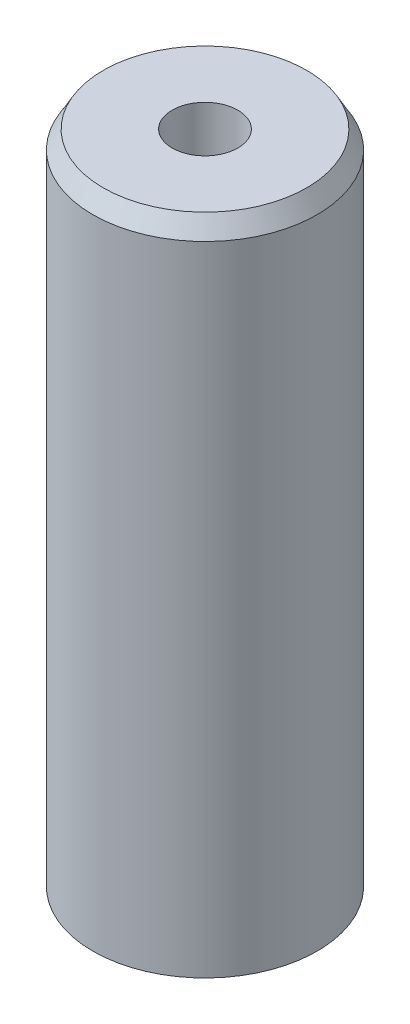
ISO-10303-21;
HEADER;
FILE_DESCRIPTION(('STEP AP214'),'2;1');
FILE_NAME('part.step','',(''),(''),'','','');
FILE_SCHEMA(('AUTOMOTIVE_DESIGN { 1 0 10303 214 1 1 1 1 }'));
ENDSEC;
DATA;
#1=APPLICATION_CONTEXT('core data for automotive mechanical design processes');
#2=APPLICATION_PROTOCOL_DEFINITION('international standard','automotive_design',2000,#1);
#3=PRODUCT_CONTEXT('',#1,'mechanical');
#4=PRODUCT('Part','Part','',(#3));
#5=PRODUCT_RELATED_PRODUCT_CATEGORY('part','',(#4));
#6=PRODUCT_DEFINITION_FORMATION('','',#4);
#7=PRODUCT_DEFINITION_CONTEXT('part definition',#1,'design');
#8=PRODUCT_DEFINITION('design','',#6,#7);
#9=PRODUCT_DEFINITION_SHAPE('','',#8);
#10=(LENGTH_UNIT() NAMED_UNIT(*) SI_UNIT(.MILLI.,.METRE.));
#11=(NAMED_UNIT(*) PLANE_ANGLE_UNIT() SI_UNIT($,.RADIAN.));
#12=(NAMED_UNIT(*) SI_UNIT($,.STERADIAN.) SOLID_ANGLE_UNIT());
#13=UNCERTAINTY_MEASURE_WITH_UNIT(LENGTH_MEASURE(1.E-05),#10,'distance_accuracy_value','');
#14=(GEOMETRIC_REPRESENTATION_CONTEXT(3) GLOBAL_UNCERTAINTY_ASSIGNED_CONTEXT((#13)) GLOBAL_UNIT_ASSIGNED_CONTEXT((#10,
#11,#12)) REPRESENTATION_CONTEXT('',''));
#15=CARTESIAN_POINT('',(0.,0.,0.));
#16=DIRECTION('',(0.,0.,1.));
#17=DIRECTION('',(1.,0.,0.));
#18=AXIS2_PLACEMENT_3D('',#15,#16,#17);
#19=CARTESIAN_POINT('',(0.,193.043494392686,0.));
#20=DIRECTION('',(0.,-1.,0.));
#21=DIRECTION('',(0.,0.,-1.));
#22=AXIS2_PLACEMENT_3D('',#19,#20,#21);
#23=CYLINDRICAL_SURFACE('',#22,32.5);
#24=CARTESIAN_POINT('',(0.,187.812756605636,0.));
#25=DIRECTION('',(0.,1.,0.));
#26=DIRECTION('',(0.,0.,1.));
#27=AXIS2_PLACEMENT_3D('',#24,#25,#26);
#28=CIRCLE('',#27,32.5);
#29=CARTESIAN_POINT('',(0.,187.812756605636,32.5));
#30=VERTEX_POINT('',#29);
#31=EDGE_CURVE('E50',#30,#30,#28,.F.);
#32=ORIENTED_EDGE('',*,*,#31,.T.);
#33=EDGE_LOOP('',(#32));
#34=FACE_BOUND('',#33,.T.);
#35=CARTESIAN_POINT('',(0.,3.01363000616731,0.));
#36=DIRECTION('',(0.,1.,0.));
#37=DIRECTION('',(0.,0.,1.));
#38=AXIS2_PLACEMENT_3D('',#35,#36,#37);
#39=CIRCLE('',#38,32.5);
#40=CARTESIAN_POINT('',(0.,3.01363000616731,32.5));
#41=VERTEX_POINT('',#40);
#42=EDGE_CURVE('E51',#41,#41,#39,.T.);
#43=ORIENTED_EDGE('',*,*,#42,.T.);
#44=EDGE_LOOP('',(#43));
#45=FACE_BOUND('',#44,.T.);
#46=ADVANCED_FACE('F39',(#34,#45),#23,.T.);
#47=CARTESIAN_POINT('',(0.,193.043494392686,0.));
#48=DIRECTION('',(0.,1.,0.));
#49=DIRECTION('',(0.,0.,1.));
#50=AXIS2_PLACEMENT_3D('',#47,#48,#49);
#51=PLANE('',#50);
#52=CARTESIAN_POINT('',(0.,193.043494392686,0.));
#53=DIRECTION('',(0.,1.,0.));
#54=DIRECTION('',(0.,0.,1.));
#55=AXIS2_PLACEMENT_3D('',#52,#53,#54);
#56=CIRCLE('',#55,29.4863699938327);
#57=CARTESIAN_POINT('',(0.,193.043494392686,29.4863699938327));
#58=VERTEX_POINT('',#57);
#59=EDGE_CURVE('E54',#58,#58,#56,.T.);
#60=ORIENTED_EDGE('',*,*,#59,.T.);
#61=EDGE_LOOP('',(#60));
#62=FACE_BOUND('',#61,.T.);
#63=CARTESIAN_POINT('',(0.,193.043494392686,0.));
#64=DIRECTION('',(0.,1.,0.));
#65=DIRECTION('',(0.,0.,1.));
#66=AXIS2_PLACEMENT_3D('',#63,#64,#65);
#67=CIRCLE('',#66,9.51298660513181);
#68=CARTESIAN_POINT('',(0.,193.043494392686,9.51298660513181));
#69=VERTEX_POINT('',#68);
#70=EDGE_CURVE('E58',#69,#69,#67,.T.);
#71=ORIENTED_EDGE('',*,*,#70,.F.);
#72=EDGE_LOOP('',(#71));
#73=FACE_BOUND('',#72,.T.);
#74=ADVANCED_FACE('F69',(#62,#73),#51,.T.);
#75=CARTESIAN_POINT('',(0.,0.,0.));
#76=DIRECTION('',(0.,1.,0.));
#77=DIRECTION('',(0.,0.,1.));
#78=AXIS2_PLACEMENT_3D('',#75,#76,#77);
#79=PLANE('',#78);
#80=CARTESIAN_POINT('',(0.,0.,0.));
#81=DIRECTION('',(0.,1.,0.));
#82=DIRECTION('',(0.,0.,1.));
#83=AXIS2_PLACEMENT_3D('',#80,#81,#82);
#84=CIRCLE('',#83,27.26926221295);
#85=CARTESIAN_POINT('',(0.,0.,27.26926221295));
#86=VERTEX_POINT('',#85);
#87=EDGE_CURVE('E10',#86,#86,#84,.F.);
#88=ORIENTED_EDGE('',*,*,#87,.T.);
#89=EDGE_LOOP('',(#88));
#90=FACE_BOUND('',#89,.T.);
#91=CARTESIAN_POINT('',(0.,0.,0.));
#92=DIRECTION('',(0.,1.,0.));
#93=DIRECTION('',(0.,0.,1.));
#94=AXIS2_PLACEMENT_3D('',#91,#92,#93);
#95=CIRCLE('',#94,9.51298660513181);
#96=CARTESIAN_POINT('',(0.,0.,9.51298660513181));
#97=VERTEX_POINT('',#96);
#98=EDGE_CURVE('E63',#97,#97,#95,.T.);
#99=ORIENTED_EDGE('',*,*,#98,.T.);
#100=EDGE_LOOP('',(#99));
#101=FACE_BOUND('',#100,.T.);
#102=ADVANCED_FACE('F75',(#90,#101),#79,.F.);
#103=CARTESIAN_POINT('',(0.,193.043494392686,0.));
#104=DIRECTION('',(0.,-1.,0.));
#105=DIRECTION('',(0.,0.,-1.));
#106=AXIS2_PLACEMENT_3D('',#103,#104,#105);
#107=CYLINDRICAL_SURFACE('',#106,9.51298660513181);
#108=ORIENTED_EDGE('',*,*,#70,.T.);
#109=EDGE_LOOP('',(#108));
#110=FACE_BOUND('',#109,.T.);
#111=ORIENTED_EDGE('',*,*,#98,.F.);
#112=EDGE_LOOP('',(#111));
#113=FACE_BOUND('',#112,.T.);
#114=ADVANCED_FACE('F70',(#110,#113),#107,.F.);
#115=CARTESIAN_POINT('',(0.,193.043494392686,0.));
#116=DIRECTION('',(0.,-1.,0.));
#117=DIRECTION('',(0.,0.,-1.));
#118=AXIS2_PLACEMENT_3D('',#115,#116,#117);
#119=CONICAL_SURFACE('',#118,29.4863699938327,0.52268955560689);
#120=ORIENTED_EDGE('',*,*,#31,.F.);
#121=EDGE_LOOP('',(#120));
#122=FACE_BOUND('',#121,.T.);
#123=ORIENTED_EDGE('',*,*,#59,.F.);
#124=EDGE_LOOP('',(#123));
#125=FACE_BOUND('',#124,.T.);
#126=ADVANCED_FACE('F81',(#122,#125),#119,.T.);
#127=CARTESIAN_POINT('',(0.,3.01363000616731,0.));
#128=DIRECTION('',(0.,1.,0.));
#129=DIRECTION('',(0.,0.,1.));
#130=AXIS2_PLACEMENT_3D('',#127,#128,#129);
#131=CONICAL_SURFACE('',#130,32.5,1.048106771188);
#132=ORIENTED_EDGE('',*,*,#87,.F.);
#133=EDGE_LOOP('',(#132));
#134=FACE_BOUND('',#133,.T.);
#135=ORIENTED_EDGE('',*,*,#42,.F.);
#136=EDGE_LOOP('',(#135));
#137=FACE_BOUND('',#136,.T.);
#138=ADVANCED_FACE('F45',(#134,#137),#131,.T.);
#139=CLOSED_SHELL('',(#46,#74,#102,#114,#126,#138));
#140=MANIFOLD_SOLID_BREP('B2',#139);
#141=ADVANCED_BREP_SHAPE_REPRESENTATION('',(#18,#140),#14);
#142=SHAPE_DEFINITION_REPRESENTATION(#9,#141);
ENDSEC;
END-ISO-10303-21;
